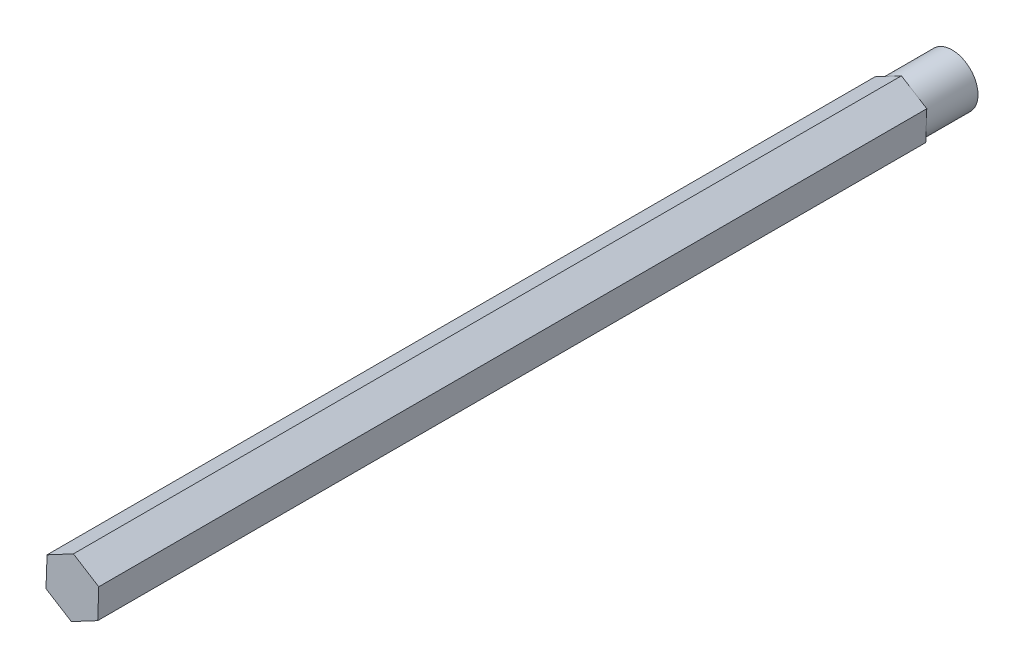
ISO-10303-21;
HEADER;
FILE_DESCRIPTION(('STEP AP214'),'2;1');
FILE_NAME('part.step','',(''),(''),'','','');
FILE_SCHEMA(('AUTOMOTIVE_DESIGN { 1 0 10303 214 1 1 1 1 }'));
ENDSEC;
DATA;
#1=APPLICATION_CONTEXT('core data for automotive mechanical design processes');
#2=APPLICATION_PROTOCOL_DEFINITION('international standard','automotive_design',2000,#1);
#3=PRODUCT_CONTEXT('',#1,'mechanical');
#4=PRODUCT('Part','Part','',(#3));
#5=PRODUCT_RELATED_PRODUCT_CATEGORY('part','',(#4));
#6=PRODUCT_DEFINITION_FORMATION('','',#4);
#7=PRODUCT_DEFINITION_CONTEXT('part definition',#1,'design');
#8=PRODUCT_DEFINITION('design','',#6,#7);
#9=PRODUCT_DEFINITION_SHAPE('','',#8);
#10=(LENGTH_UNIT() NAMED_UNIT(*) SI_UNIT(.MILLI.,.METRE.));
#11=(NAMED_UNIT(*) PLANE_ANGLE_UNIT() SI_UNIT($,.RADIAN.));
#12=(NAMED_UNIT(*) SI_UNIT($,.STERADIAN.) SOLID_ANGLE_UNIT());
#13=UNCERTAINTY_MEASURE_WITH_UNIT(LENGTH_MEASURE(1.E-05),#10,'distance_accuracy_value','');
#14=(GEOMETRIC_REPRESENTATION_CONTEXT(3) GLOBAL_UNCERTAINTY_ASSIGNED_CONTEXT((#13)) GLOBAL_UNIT_ASSIGNED_CONTEXT((#10,
#11,#12)) REPRESENTATION_CONTEXT('',''));
#15=CARTESIAN_POINT('',(0.,0.,0.));
#16=DIRECTION('',(0.,0.,1.));
#17=DIRECTION('',(1.,0.,0.));
#18=AXIS2_PLACEMENT_3D('',#15,#16,#17);
#19=CARTESIAN_POINT('',(0.,0.,0.));
#20=DIRECTION('',(0.,0.,1.));
#21=DIRECTION('',(1.,0.,0.));
#22=AXIS2_PLACEMENT_3D('',#19,#20,#21);
#23=PLANE('',#22);
#24=CARTESIAN_POINT('',(0.,0.,0.));
#25=DIRECTION('',(0.,0.,-1.));
#26=DIRECTION('',(-1.,0.,0.));
#27=AXIS2_PLACEMENT_3D('',#24,#25,#26);
#28=CIRCLE('',#27,6.35);
#29=CARTESIAN_POINT('',(-6.34611090208934,0.222208052020816,0.));
#30=VERTEX_POINT('',#29);
#31=CARTESIAN_POINT('',(-2.9806176330692,5.60699728245317,0.));
#32=VERTEX_POINT('',#31);
#33=EDGE_CURVE('E49',#30,#32,#28,.T.);
#34=ORIENTED_EDGE('',*,*,#33,.F.);
#35=DIRECTION('',(-0.0349933940190261,-0.999387543636116,0.));
#36=VECTOR('',#35,1.);
#37=CARTESIAN_POINT('',(-6.21781902343904,3.88613688964933,0.));
#38=LINE('',#37,#36);
#39=CARTESIAN_POINT('',(-6.21781902343904,3.88613688964933,0.));
#40=VERTEX_POINT('',#39);
#41=EDGE_CURVE('E117',#40,#30,#38,.T.);
#42=ORIENTED_EDGE('',*,*,#41,.F.);
#43=DIRECTION('',(-0.882991698024119,-0.469388603632942,0.));
#44=VECTOR('',#43,1.);
#45=CARTESIAN_POINT('',(0.256583757300646,7.32785767525702,0.));
#46=LINE('',#45,#44);
#47=EDGE_CURVE('E141',#32,#40,#46,.T.);
#48=ORIENTED_EDGE('',*,*,#47,.F.);
#49=EDGE_LOOP('',(#34,#42,#48));
#50=FACE_BOUND('',#49,.T.);
#51=ADVANCED_FACE('F38',(#50),#23,.F.);
#52=CARTESIAN_POINT('',(3.36549326902016,5.38478923043236,0.));
#53=VERTEX_POINT('',#52);
#54=EDGE_CURVE('E11',#32,#53,#28,.T.);
#55=ORIENTED_EDGE('',*,*,#54,.F.);
#56=CARTESIAN_POINT('',(0.256583757300646,7.32785767525702,0.));
#57=VERTEX_POINT('',#56);
#58=EDGE_CURVE('E139',#57,#32,#46,.T.);
#59=ORIENTED_EDGE('',*,*,#58,.F.);
#60=DIRECTION('',(-0.847998304005092,0.529998940003173,0.));
#61=VECTOR('',#60,1.);
#62=CARTESIAN_POINT('',(6.47440278073968,3.44172078560769,0.));
#63=LINE('',#62,#61);
#64=EDGE_CURVE('E179',#53,#57,#63,.T.);
#65=ORIENTED_EDGE('',*,*,#64,.F.);
#66=EDGE_LOOP('',(#55,#59,#65));
#67=FACE_BOUND('',#66,.T.);
#68=ADVANCED_FACE('F209',(#67),#23,.F.);
#69=CARTESIAN_POINT('',(6.34611090208936,-0.222208052020818,0.));
#70=VERTEX_POINT('',#69);
#71=EDGE_CURVE('E47',#53,#70,#28,.T.);
#72=ORIENTED_EDGE('',*,*,#71,.F.);
#73=CARTESIAN_POINT('',(6.47440278073968,3.44172078560769,0.));
#74=VERTEX_POINT('',#73);
#75=EDGE_CURVE('E180',#74,#53,#63,.T.);
#76=ORIENTED_EDGE('',*,*,#75,.F.);
#77=DIRECTION('',(0.0349933940190264,0.999387543636116,0.));
#78=VECTOR('',#77,1.);
#79=CARTESIAN_POINT('',(6.21781902343904,-3.88613688964933,0.));
#80=LINE('',#79,#78);
#81=EDGE_CURVE('E174',#70,#74,#80,.T.);
#82=ORIENTED_EDGE('',*,*,#81,.F.);
#83=EDGE_LOOP('',(#72,#76,#82));
#84=FACE_BOUND('',#83,.T.);
#85=ADVANCED_FACE('F204',(#84),#23,.F.);
#86=CARTESIAN_POINT('',(2.9806176330692,-5.60699728245318,0.));
#87=VERTEX_POINT('',#86);
#88=EDGE_CURVE('E56',#70,#87,#28,.T.);
#89=ORIENTED_EDGE('',*,*,#88,.F.);
#90=CARTESIAN_POINT('',(6.21781902343904,-3.88613688964933,0.));
#91=VERTEX_POINT('',#90);
#92=EDGE_CURVE('E176',#91,#70,#80,.T.);
#93=ORIENTED_EDGE('',*,*,#92,.F.);
#94=DIRECTION('',(0.882991698024119,0.469388603632943,0.));
#95=VECTOR('',#94,1.);
#96=CARTESIAN_POINT('',(-0.256583757300642,-7.32785767525702,0.));
#97=LINE('',#96,#95);
#98=EDGE_CURVE('E175',#87,#91,#97,.T.);
#99=ORIENTED_EDGE('',*,*,#98,.F.);
#100=EDGE_LOOP('',(#89,#93,#99));
#101=FACE_BOUND('',#100,.T.);
#102=ADVANCED_FACE('F256',(#101),#23,.F.);
#103=CARTESIAN_POINT('',(-3.36549326902016,-5.38478923043236,0.));
#104=VERTEX_POINT('',#103);
#105=EDGE_CURVE('E147',#87,#104,#28,.T.);
#106=ORIENTED_EDGE('',*,*,#105,.F.);
#107=CARTESIAN_POINT('',(-0.256583757300642,-7.32785767525702,0.));
#108=VERTEX_POINT('',#107);
#109=EDGE_CURVE('E171',#108,#87,#97,.T.);
#110=ORIENTED_EDGE('',*,*,#109,.F.);
#111=DIRECTION('',(0.847998304005092,-0.529998940003173,0.));
#112=VECTOR('',#111,1.);
#113=CARTESIAN_POINT('',(-6.47440278073968,-3.44172078560769,0.));
#114=LINE('',#113,#112);
#115=EDGE_CURVE('E129',#104,#108,#114,.T.);
#116=ORIENTED_EDGE('',*,*,#115,.F.);
#117=EDGE_LOOP('',(#106,#110,#116));
#118=FACE_BOUND('',#117,.T.);
#119=ADVANCED_FACE('F233',(#118),#23,.F.);
#120=CARTESIAN_POINT('',(-0.256583757300642,-7.32785767525702,203.2));
#121=DIRECTION('',(-0.469388603632942,0.882991698024119,0.));
#122=DIRECTION('',(-0.882991698024119,-0.469388603632942,0.));
#123=AXIS2_PLACEMENT_3D('',#120,#121,#122);
#124=PLANE('',#123);
#125=ORIENTED_EDGE('',*,*,#109,.T.);
#126=ORIENTED_EDGE('',*,*,#98,.T.);
#127=DIRECTION('',(0.,0.,-1.));
#128=VECTOR('',#127,1.);
#129=CARTESIAN_POINT('',(6.21781902343904,-3.88613688964933,203.2));
#130=LINE('',#129,#128);
#131=CARTESIAN_POINT('',(6.21781902343904,-3.88613688964933,203.2));
#132=VERTEX_POINT('',#131);
#133=EDGE_CURVE('E42',#132,#91,#130,.T.);
#134=ORIENTED_EDGE('',*,*,#133,.F.);
#135=DIRECTION('',(0.882991698024119,0.469388603632943,0.));
#136=VECTOR('',#135,1.);
#137=CARTESIAN_POINT('',(-0.256583757300642,-7.32785767525702,203.2));
#138=LINE('',#137,#136);
#139=CARTESIAN_POINT('',(-0.256583757300642,-7.32785767525702,203.2));
#140=VERTEX_POINT('',#139);
#141=EDGE_CURVE('E153',#140,#132,#138,.T.);
#142=ORIENTED_EDGE('',*,*,#141,.F.);
#143=DIRECTION('',(0.,0.,-1.));
#144=VECTOR('',#143,1.);
#145=CARTESIAN_POINT('',(-0.256583757300642,-7.32785767525702,203.2));
#146=LINE('',#145,#144);
#147=EDGE_CURVE('E170',#140,#108,#146,.T.);
#148=ORIENTED_EDGE('',*,*,#147,.T.);
#149=EDGE_LOOP('',(#125,#126,#134,#142,#148));
#150=FACE_BOUND('',#149,.T.);
#151=ADVANCED_FACE('F40',(#150),#124,.F.);
#152=CARTESIAN_POINT('',(6.21781902343904,-3.88613688964933,203.2));
#153=DIRECTION('',(-0.999387543636116,0.0349933940190264,0.));
#154=DIRECTION('',(-0.0349933940190264,-0.999387543636116,0.));
#155=AXIS2_PLACEMENT_3D('',#152,#153,#154);
#156=PLANE('',#155);
#157=ORIENTED_EDGE('',*,*,#92,.T.);
#158=ORIENTED_EDGE('',*,*,#81,.T.);
#159=DIRECTION('',(0.,0.,-1.));
#160=VECTOR('',#159,1.);
#161=CARTESIAN_POINT('',(6.47440278073968,3.44172078560769,203.2));
#162=LINE('',#161,#160);
#163=CARTESIAN_POINT('',(6.47440278073968,3.44172078560769,203.2));
#164=VERTEX_POINT('',#163);
#165=EDGE_CURVE('E150',#164,#74,#162,.T.);
#166=ORIENTED_EDGE('',*,*,#165,.F.);
#167=DIRECTION('',(0.0349933940190264,0.999387543636116,0.));
#168=VECTOR('',#167,1.);
#169=CARTESIAN_POINT('',(6.21781902343904,-3.88613688964933,203.2));
#170=LINE('',#169,#168);
#171=EDGE_CURVE('E156',#132,#164,#170,.T.);
#172=ORIENTED_EDGE('',*,*,#171,.F.);
#173=ORIENTED_EDGE('',*,*,#133,.T.);
#174=EDGE_LOOP('',(#157,#158,#166,#172,#173));
#175=FACE_BOUND('',#174,.T.);
#176=ADVANCED_FACE('F205',(#175),#156,.F.);
#177=CARTESIAN_POINT('',(6.47440278073968,3.44172078560769,203.2));
#178=DIRECTION('',(-0.529998940003173,-0.847998304005092,0.));
#179=DIRECTION('',(0.847998304005092,-0.529998940003173,0.));
#180=AXIS2_PLACEMENT_3D('',#177,#178,#179);
#181=PLANE('',#180);
#182=ORIENTED_EDGE('',*,*,#75,.T.);
#183=ORIENTED_EDGE('',*,*,#64,.T.);
#184=DIRECTION('',(0.,0.,-1.));
#185=VECTOR('',#184,1.);
#186=CARTESIAN_POINT('',(0.256583757300646,7.32785767525702,203.2));
#187=LINE('',#186,#185);
#188=CARTESIAN_POINT('',(0.256583757300646,7.32785767525702,203.2));
#189=VERTEX_POINT('',#188);
#190=EDGE_CURVE('E193',#189,#57,#187,.T.);
#191=ORIENTED_EDGE('',*,*,#190,.F.);
#192=DIRECTION('',(-0.847998304005092,0.529998940003173,0.));
#193=VECTOR('',#192,1.);
#194=CARTESIAN_POINT('',(6.47440278073968,3.44172078560769,203.2));
#195=LINE('',#194,#193);
#196=EDGE_CURVE('E158',#164,#189,#195,.T.);
#197=ORIENTED_EDGE('',*,*,#196,.F.);
#198=ORIENTED_EDGE('',*,*,#165,.T.);
#199=EDGE_LOOP('',(#182,#183,#191,#197,#198));
#200=FACE_BOUND('',#199,.T.);
#201=ADVANCED_FACE('F201',(#200),#181,.F.);
#202=CARTESIAN_POINT('',(0.256583757300646,7.32785767525702,203.2));
#203=DIRECTION('',(0.469388603632942,-0.882991698024119,0.));
#204=DIRECTION('',(0.882991698024119,0.469388603632942,0.));
#205=AXIS2_PLACEMENT_3D('',#202,#203,#204);
#206=PLANE('',#205);
#207=ORIENTED_EDGE('',*,*,#58,.T.);
#208=ORIENTED_EDGE('',*,*,#47,.T.);
#209=DIRECTION('',(0.,0.,-1.));
#210=VECTOR('',#209,1.);
#211=CARTESIAN_POINT('',(-6.21781902343904,3.88613688964933,203.2));
#212=LINE('',#211,#210);
#213=CARTESIAN_POINT('',(-6.21781902343904,3.88613688964933,203.2));
#214=VERTEX_POINT('',#213);
#215=EDGE_CURVE('E125',#214,#40,#212,.T.);
#216=ORIENTED_EDGE('',*,*,#215,.F.);
#217=DIRECTION('',(-0.882991698024119,-0.469388603632942,0.));
#218=VECTOR('',#217,1.);
#219=CARTESIAN_POINT('',(0.256583757300646,7.32785767525702,203.2));
#220=LINE('',#219,#218);
#221=EDGE_CURVE('E161',#189,#214,#220,.T.);
#222=ORIENTED_EDGE('',*,*,#221,.F.);
#223=ORIENTED_EDGE('',*,*,#190,.T.);
#224=EDGE_LOOP('',(#207,#208,#216,#222,#223));
#225=FACE_BOUND('',#224,.T.);
#226=ADVANCED_FACE('F212',(#225),#206,.F.);
#227=CARTESIAN_POINT('',(-6.21781902343904,3.88613688964933,203.2));
#228=DIRECTION('',(0.999387543636116,-0.0349933940190261,0.));
#229=DIRECTION('',(0.0349933940190261,0.999387543636116,0.));
#230=AXIS2_PLACEMENT_3D('',#227,#228,#229);
#231=PLANE('',#230);
#232=ORIENTED_EDGE('',*,*,#41,.T.);
#233=CARTESIAN_POINT('',(-6.47440278073968,-3.44172078560769,0.));
#234=VERTEX_POINT('',#233);
#235=EDGE_CURVE('E121',#30,#234,#38,.T.);
#236=ORIENTED_EDGE('',*,*,#235,.T.);
#237=DIRECTION('',(0.,0.,-1.));
#238=VECTOR('',#237,1.);
#239=CARTESIAN_POINT('',(-6.47440278073968,-3.44172078560769,203.2));
#240=LINE('',#239,#238);
#241=CARTESIAN_POINT('',(-6.47440278073968,-3.44172078560769,203.2));
#242=VERTEX_POINT('',#241);
#243=EDGE_CURVE('E188',#242,#234,#240,.T.);
#244=ORIENTED_EDGE('',*,*,#243,.F.);
#245=DIRECTION('',(-0.0349933940190261,-0.999387543636116,0.));
#246=VECTOR('',#245,1.);
#247=CARTESIAN_POINT('',(-6.21781902343904,3.88613688964933,203.2));
#248=LINE('',#247,#246);
#249=EDGE_CURVE('E164',#214,#242,#248,.T.);
#250=ORIENTED_EDGE('',*,*,#249,.F.);
#251=ORIENTED_EDGE('',*,*,#215,.T.);
#252=EDGE_LOOP('',(#232,#236,#244,#250,#251));
#253=FACE_BOUND('',#252,.T.);
#254=ADVANCED_FACE('F119',(#253),#231,.F.);
#255=CARTESIAN_POINT('',(-6.47440278073968,-3.44172078560769,203.2));
#256=DIRECTION('',(0.529998940003173,0.847998304005092,0.));
#257=DIRECTION('',(-0.847998304005092,0.529998940003173,0.));
#258=AXIS2_PLACEMENT_3D('',#255,#256,#257);
#259=PLANE('',#258);
#260=EDGE_CURVE('E138',#234,#104,#114,.T.);
#261=ORIENTED_EDGE('',*,*,#260,.T.);
#262=ORIENTED_EDGE('',*,*,#115,.T.);
#263=ORIENTED_EDGE('',*,*,#147,.F.);
#264=DIRECTION('',(0.847998304005092,-0.529998940003173,0.));
#265=VECTOR('',#264,1.);
#266=CARTESIAN_POINT('',(-6.47440278073968,-3.44172078560769,203.2));
#267=LINE('',#266,#265);
#268=EDGE_CURVE('E167',#242,#140,#267,.T.);
#269=ORIENTED_EDGE('',*,*,#268,.F.);
#270=ORIENTED_EDGE('',*,*,#243,.T.);
#271=EDGE_LOOP('',(#261,#262,#263,#269,#270));
#272=FACE_BOUND('',#271,.T.);
#273=ADVANCED_FACE('F240',(#272),#259,.F.);
#274=CARTESIAN_POINT('',(0.,0.,203.2));
#275=DIRECTION('',(0.,0.,1.));
#276=DIRECTION('',(1.,0.,0.));
#277=AXIS2_PLACEMENT_3D('',#274,#275,#276);
#278=PLANE('',#277);
#279=ORIENTED_EDGE('',*,*,#141,.T.);
#280=ORIENTED_EDGE('',*,*,#171,.T.);
#281=ORIENTED_EDGE('',*,*,#196,.T.);
#282=ORIENTED_EDGE('',*,*,#221,.T.);
#283=ORIENTED_EDGE('',*,*,#249,.T.);
#284=ORIENTED_EDGE('',*,*,#268,.T.);
#285=EDGE_LOOP('',(#279,#280,#281,#282,#283,#284));
#286=FACE_BOUND('',#285,.T.);
#287=ADVANCED_FACE('F214',(#286),#278,.T.);
#288=EDGE_CURVE('E135',#104,#30,#28,.T.);
#289=ORIENTED_EDGE('',*,*,#288,.F.);
#290=ORIENTED_EDGE('',*,*,#260,.F.);
#291=ORIENTED_EDGE('',*,*,#235,.F.);
#292=EDGE_LOOP('',(#289,#290,#291));
#293=FACE_BOUND('',#292,.T.);
#294=ADVANCED_FACE('F133',(#293),#23,.F.);
#295=CARTESIAN_POINT('',(0.,0.,-12.7));
#296=DIRECTION('',(0.,0.,1.));
#297=DIRECTION('',(1.,0.,0.));
#298=AXIS2_PLACEMENT_3D('',#295,#296,#297);
#299=CYLINDRICAL_SURFACE('',#298,6.35);
#300=CARTESIAN_POINT('',(0.,0.,-12.7));
#301=DIRECTION('',(0.,0.,-1.));
#302=DIRECTION('',(-1.,0.,0.));
#303=AXIS2_PLACEMENT_3D('',#300,#301,#302);
#304=CIRCLE('',#303,6.35);
#305=CARTESIAN_POINT('',(-6.35,0.,-12.7));
#306=VERTEX_POINT('',#305);
#307=EDGE_CURVE('E144',#306,#306,#304,.T.);
#308=ORIENTED_EDGE('',*,*,#307,.F.);
#309=EDGE_LOOP('',(#308));
#310=FACE_BOUND('',#309,.T.);
#311=ORIENTED_EDGE('',*,*,#33,.T.);
#312=ORIENTED_EDGE('',*,*,#54,.T.);
#313=ORIENTED_EDGE('',*,*,#71,.T.);
#314=ORIENTED_EDGE('',*,*,#88,.T.);
#315=ORIENTED_EDGE('',*,*,#105,.T.);
#316=ORIENTED_EDGE('',*,*,#288,.T.);
#317=EDGE_LOOP('',(#311,#312,#313,#314,#315,#316));
#318=FACE_BOUND('',#317,.T.);
#319=ADVANCED_FACE('F146',(#310,#318),#299,.T.);
#320=CARTESIAN_POINT('',(0.,0.,-12.7));
#321=DIRECTION('',(0.,0.,-1.));
#322=DIRECTION('',(-1.,0.,0.));
#323=AXIS2_PLACEMENT_3D('',#320,#321,#322);
#324=PLANE('',#323);
#325=ORIENTED_EDGE('',*,*,#307,.T.);
#326=EDGE_LOOP('',(#325));
#327=FACE_BOUND('',#326,.T.);
#328=ADVANCED_FACE('F223',(#327),#324,.T.);
#329=CLOSED_SHELL('',(#51,#68,#85,#102,#119,#151,#176,#201,#226,#254,#273,#287,#294,#319,#328));
#330=MANIFOLD_SOLID_BREP('B2',#329);
#331=ADVANCED_BREP_SHAPE_REPRESENTATION('',(#18,#330),#14);
#332=SHAPE_DEFINITION_REPRESENTATION(#9,#331);
ENDSEC;
END-ISO-10303-21;
